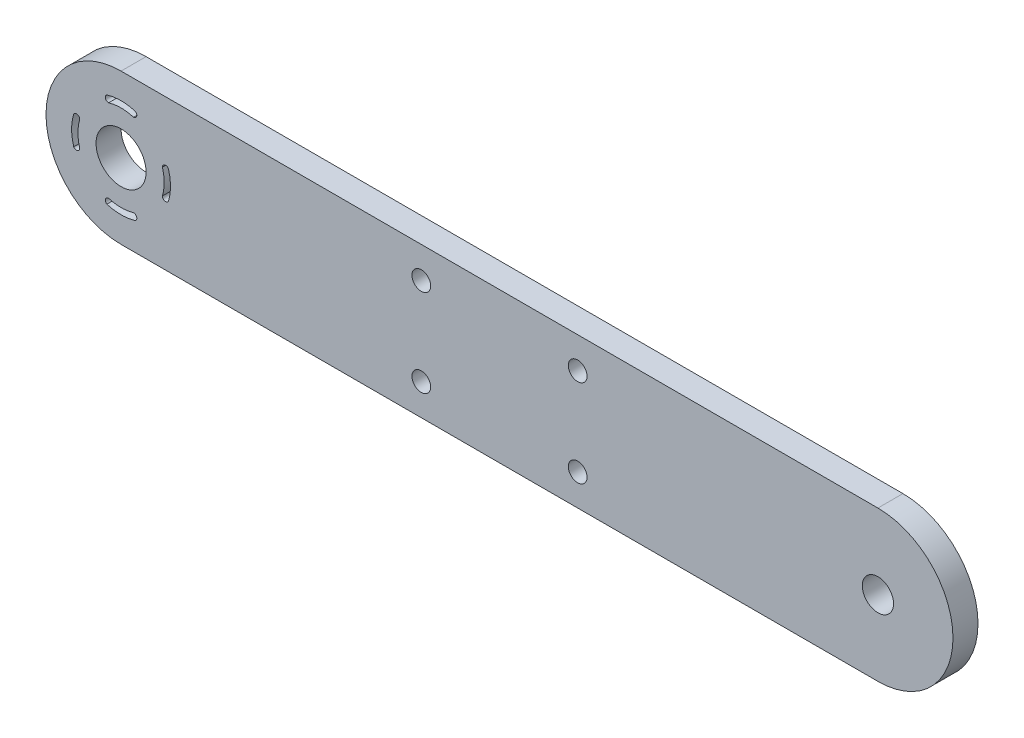
ISO-10303-21;
HEADER;
FILE_DESCRIPTION(('STEP AP214'),'2;1');
FILE_NAME('part.step','',(''),(''),'','','');
FILE_SCHEMA(('AUTOMOTIVE_DESIGN { 1 0 10303 214 1 1 1 1 }'));
ENDSEC;
DATA;
#1=APPLICATION_CONTEXT('core data for automotive mechanical design processes');
#2=APPLICATION_PROTOCOL_DEFINITION('international standard','automotive_design',2000,#1);
#3=PRODUCT_CONTEXT('',#1,'mechanical');
#4=PRODUCT('Part','Part','',(#3));
#5=PRODUCT_RELATED_PRODUCT_CATEGORY('part','',(#4));
#6=PRODUCT_DEFINITION_FORMATION('','',#4);
#7=PRODUCT_DEFINITION_CONTEXT('part definition',#1,'design');
#8=PRODUCT_DEFINITION('design','',#6,#7);
#9=PRODUCT_DEFINITION_SHAPE('','',#8);
#10=(LENGTH_UNIT() NAMED_UNIT(*) SI_UNIT(.MILLI.,.METRE.));
#11=(NAMED_UNIT(*) PLANE_ANGLE_UNIT() SI_UNIT($,.RADIAN.));
#12=(NAMED_UNIT(*) SI_UNIT($,.STERADIAN.) SOLID_ANGLE_UNIT());
#13=UNCERTAINTY_MEASURE_WITH_UNIT(LENGTH_MEASURE(1.E-05),#10,'distance_accuracy_value','');
#14=(GEOMETRIC_REPRESENTATION_CONTEXT(3) GLOBAL_UNCERTAINTY_ASSIGNED_CONTEXT((#13)) GLOBAL_UNIT_ASSIGNED_CONTEXT((#10,
#11,#12)) REPRESENTATION_CONTEXT('',''));
#15=CARTESIAN_POINT('',(0.,0.,0.));
#16=DIRECTION('',(0.,0.,1.));
#17=DIRECTION('',(1.,0.,0.));
#18=AXIS2_PLACEMENT_3D('',#15,#16,#17);
#19=CARTESIAN_POINT('',(12.0000004605686,12.0000001097863,4.));
#20=DIRECTION('',(0.,0.,1.));
#21=DIRECTION('',(1.,0.,0.));
#22=AXIS2_PLACEMENT_3D('',#19,#20,#21);
#23=PLANE('',#22);
#24=CARTESIAN_POINT('',(12.0000004605686,12.0000001097863,4.));
#25=DIRECTION('',(0.,0.,1.));
#26=DIRECTION('',(1.,0.,0.));
#27=AXIS2_PLACEMENT_3D('',#24,#25,#26);
#28=CIRCLE('',#27,7.89993735833253);
#29=CARTESIAN_POINT('',(14.270331999233,19.5666773838693,4.));
#30=VERTEX_POINT('',#29);
#31=CARTESIAN_POINT('',(9.72966892190426,19.5666773838693,4.));
#32=VERTEX_POINT('',#31);
#33=EDGE_CURVE('E207',#30,#32,#28,.T.);
#34=ORIENTED_EDGE('',*,*,#33,.F.);
#35=CARTESIAN_POINT('',(14.0000004605686,19.1232203595606,4.));
#36=DIRECTION('',(0.,0.,1.));
#37=DIRECTION('',(1.,0.,0.));
#38=AXIS2_PLACEMENT_3D('',#35,#36,#37);
#39=CIRCLE('',#38,0.519358520874882);
#40=CARTESIAN_POINT('',(14.0000004605685,18.6038618386857,4.));
#41=VERTEX_POINT('',#40);
#42=EDGE_CURVE('E205',#41,#30,#39,.T.);
#43=ORIENTED_EDGE('',*,*,#42,.F.);
#44=CARTESIAN_POINT('',(12.0000004605686,12.0000001097863,4.));
#45=DIRECTION('',(0.,0.,-1.));
#46=DIRECTION('',(1.,0.,0.));
#47=AXIS2_PLACEMENT_3D('',#44,#45,#46);
#48=CIRCLE('',#47,6.90007171951293);
#49=CARTESIAN_POINT('',(10.0000004605687,18.6038618386857,4.));
#50=VERTEX_POINT('',#49);
#51=EDGE_CURVE('E213',#50,#41,#48,.T.);
#52=ORIENTED_EDGE('',*,*,#51,.F.);
#53=CARTESIAN_POINT('',(10.0000004605686,19.1232203595606,4.));
#54=DIRECTION('',(0.,0.,1.));
#55=DIRECTION('',(1.,0.,0.));
#56=AXIS2_PLACEMENT_3D('',#53,#54,#55);
#57=CIRCLE('',#56,0.51935852087488);
#58=EDGE_CURVE('E210',#32,#50,#57,.T.);
#59=ORIENTED_EDGE('',*,*,#58,.F.);
#60=EDGE_LOOP('',(#34,#43,#52,#59));
#61=FACE_BOUND('',#60,.T.);
#62=CARTESIAN_POINT('',(12.0000004605686,12.0000001097863,4.));
#63=DIRECTION('',(0.,0.,1.));
#64=DIRECTION('',(1.,0.,0.));
#65=AXIS2_PLACEMENT_3D('',#62,#63,#64);
#66=CIRCLE('',#65,7.89993735833253);
#67=CARTESIAN_POINT('',(9.72966892190425,4.43332283570335,4.));
#68=VERTEX_POINT('',#67);
#69=CARTESIAN_POINT('',(14.270331999233,4.43332283570335,4.));
#70=VERTEX_POINT('',#69);
#71=EDGE_CURVE('E269',#68,#70,#66,.T.);
#72=ORIENTED_EDGE('',*,*,#71,.F.);
#73=CARTESIAN_POINT('',(10.0000004605686,4.87677986001203,4.));
#74=DIRECTION('',(0.,0.,1.));
#75=DIRECTION('',(1.,0.,0.));
#76=AXIS2_PLACEMENT_3D('',#73,#74,#75);
#77=CIRCLE('',#76,0.51935852087488);
#78=CARTESIAN_POINT('',(10.0000004605687,5.3961383808869,4.));
#79=VERTEX_POINT('',#78);
#80=EDGE_CURVE('E267',#79,#68,#77,.T.);
#81=ORIENTED_EDGE('',*,*,#80,.F.);
#82=CARTESIAN_POINT('',(12.0000004605686,12.0000001097863,4.));
#83=DIRECTION('',(0.,0.,-1.));
#84=DIRECTION('',(1.,0.,0.));
#85=AXIS2_PLACEMENT_3D('',#82,#83,#84);
#86=CIRCLE('',#85,6.90007171951293);
#87=CARTESIAN_POINT('',(14.0000004605685,5.3961383808869,4.));
#88=VERTEX_POINT('',#87);
#89=EDGE_CURVE('E275',#88,#79,#86,.T.);
#90=ORIENTED_EDGE('',*,*,#89,.F.);
#91=CARTESIAN_POINT('',(14.0000004605686,4.87677986001203,4.));
#92=DIRECTION('',(0.,0.,1.));
#93=DIRECTION('',(1.,0.,0.));
#94=AXIS2_PLACEMENT_3D('',#91,#92,#93);
#95=CIRCLE('',#94,0.51935852087488);
#96=EDGE_CURVE('E272',#70,#88,#95,.T.);
#97=ORIENTED_EDGE('',*,*,#96,.F.);
#98=EDGE_LOOP('',(#72,#81,#90,#97));
#99=FACE_BOUND('',#98,.T.);
#100=CARTESIAN_POINT('',(85.0000004605686,19.0000001097863,4.));
#101=DIRECTION('',(0.,0.,1.));
#102=DIRECTION('',(1.,0.,0.));
#103=AXIS2_PLACEMENT_3D('',#100,#101,#102);
#104=CIRCLE('',#103,1.5);
#105=CARTESIAN_POINT('',(86.5000004605686,19.0000001097863,4.));
#106=VERTEX_POINT('',#105);
#107=EDGE_CURVE('E304',#106,#106,#104,.T.);
#108=ORIENTED_EDGE('',*,*,#107,.F.);
#109=EDGE_LOOP('',(#108));
#110=FACE_BOUND('',#109,.T.);
#111=CARTESIAN_POINT('',(60.0000004605686,19.0000001097863,4.));
#112=DIRECTION('',(0.,0.,1.));
#113=DIRECTION('',(1.,0.,0.));
#114=AXIS2_PLACEMENT_3D('',#111,#112,#113);
#115=CIRCLE('',#114,1.5);
#116=CARTESIAN_POINT('',(61.5000004605686,19.0000001097863,4.));
#117=VERTEX_POINT('',#116);
#118=EDGE_CURVE('E316',#117,#117,#115,.T.);
#119=ORIENTED_EDGE('',*,*,#118,.F.);
#120=EDGE_LOOP('',(#119));
#121=FACE_BOUND('',#120,.T.);
#122=CARTESIAN_POINT('',(12.0000004605686,12.0000001097863,4.));
#123=DIRECTION('',(0.,0.,1.));
#124=DIRECTION('',(1.,0.,0.));
#125=AXIS2_PLACEMENT_3D('',#122,#123,#124);
#126=CIRCLE('',#125,4.);
#127=CARTESIAN_POINT('',(16.0000004605686,12.0000001097863,4.));
#128=VERTEX_POINT('',#127);
#129=EDGE_CURVE('E328',#128,#128,#126,.T.);
#130=ORIENTED_EDGE('',*,*,#129,.F.);
#131=EDGE_LOOP('',(#130));
#132=FACE_BOUND('',#131,.T.);
#133=CARTESIAN_POINT('',(12.0000004605686,12.0000001097863,4.));
#134=DIRECTION('',(0.,0.,1.));
#135=DIRECTION('',(1.,0.,0.));
#136=AXIS2_PLACEMENT_3D('',#133,#134,#135);
#137=CIRCLE('',#136,12.);
#138=CARTESIAN_POINT('',(12.0000004605686,24.0000001097863,4.));
#139=VERTEX_POINT('',#138);
#140=CARTESIAN_POINT('',(12.0000004605686,1.09786320479088E-07,4.));
#141=VERTEX_POINT('',#140);
#142=EDGE_CURVE('E334',#139,#141,#137,.T.);
#143=ORIENTED_EDGE('',*,*,#142,.T.);
#144=DIRECTION('',(1.,0.,0.));
#145=VECTOR('',#144,1.);
#146=CARTESIAN_POINT('',(133.000000460569,1.09786320479088E-07,4.));
#147=LINE('',#146,#145);
#148=CARTESIAN_POINT('',(133.000000460569,1.097863206595E-07,4.));
#149=VERTEX_POINT('',#148);
#150=EDGE_CURVE('E337',#141,#149,#147,.T.);
#151=ORIENTED_EDGE('',*,*,#150,.T.);
#152=CARTESIAN_POINT('',(133.000000460569,12.0000001097863,4.));
#153=DIRECTION('',(0.,0.,1.));
#154=DIRECTION('',(1.,0.,0.));
#155=AXIS2_PLACEMENT_3D('',#152,#153,#154);
#156=CIRCLE('',#155,12.);
#157=CARTESIAN_POINT('',(133.000000460569,24.0000001097863,4.));
#158=VERTEX_POINT('',#157);
#159=EDGE_CURVE('E340',#149,#158,#156,.T.);
#160=ORIENTED_EDGE('',*,*,#159,.T.);
#161=DIRECTION('',(-1.,0.,0.));
#162=VECTOR('',#161,1.);
#163=CARTESIAN_POINT('',(12.0000004605686,24.0000001097863,4.));
#164=LINE('',#163,#162);
#165=EDGE_CURVE('E342',#158,#139,#164,.T.);
#166=ORIENTED_EDGE('',*,*,#165,.T.);
#167=EDGE_LOOP('',(#143,#151,#160,#166));
#168=FACE_BOUND('',#167,.T.);
#169=CARTESIAN_POINT('',(60.0000004605686,5.00000010978632,4.));
#170=DIRECTION('',(0.,0.,1.));
#171=DIRECTION('',(1.,0.,0.));
#172=AXIS2_PLACEMENT_3D('',#169,#170,#171);
#173=CIRCLE('',#172,1.5);
#174=CARTESIAN_POINT('',(61.5000004605686,5.00000010978632,4.));
#175=VERTEX_POINT('',#174);
#176=EDGE_CURVE('E322',#175,#175,#173,.T.);
#177=ORIENTED_EDGE('',*,*,#176,.F.);
#178=EDGE_LOOP('',(#177));
#179=FACE_BOUND('',#178,.T.);
#180=CARTESIAN_POINT('',(85.0000004605686,5.00000010978632,4.));
#181=DIRECTION('',(0.,0.,1.));
#182=DIRECTION('',(1.,0.,0.));
#183=AXIS2_PLACEMENT_3D('',#180,#181,#182);
#184=CIRCLE('',#183,1.5);
#185=CARTESIAN_POINT('',(86.5000004605686,5.00000010978632,4.));
#186=VERTEX_POINT('',#185);
#187=EDGE_CURVE('E310',#186,#186,#184,.T.);
#188=ORIENTED_EDGE('',*,*,#187,.F.);
#189=EDGE_LOOP('',(#188));
#190=FACE_BOUND('',#189,.T.);
#191=CARTESIAN_POINT('',(133.000000460569,12.0000001097863,4.));
#192=DIRECTION('',(0.,0.,1.));
#193=DIRECTION('',(1.,0.,0.));
#194=AXIS2_PLACEMENT_3D('',#191,#192,#193);
#195=CIRCLE('',#194,2.5);
#196=CARTESIAN_POINT('',(135.500000460569,12.0000001097863,4.));
#197=VERTEX_POINT('',#196);
#198=EDGE_CURVE('E298',#197,#197,#195,.T.);
#199=ORIENTED_EDGE('',*,*,#198,.F.);
#200=EDGE_LOOP('',(#199));
#201=FACE_BOUND('',#200,.T.);
#202=CARTESIAN_POINT('',(12.0000004605686,12.0000001097863,4.));
#203=DIRECTION('',(0.,0.,1.));
#204=DIRECTION('',(1.,0.,0.));
#205=AXIS2_PLACEMENT_3D('',#202,#203,#204);
#206=CIRCLE('',#205,7.89993735833252);
#207=CARTESIAN_POINT('',(19.5666777346516,9.72966857112182,4.));
#208=VERTEX_POINT('',#207);
#209=CARTESIAN_POINT('',(19.5666777346516,14.2703316484507,4.));
#210=VERTEX_POINT('',#209);
#211=EDGE_CURVE('E238',#208,#210,#206,.T.);
#212=ORIENTED_EDGE('',*,*,#211,.F.);
#213=CARTESIAN_POINT('',(19.1232207103428,10.0000001097863,4.));
#214=DIRECTION('',(0.,0.,1.));
#215=DIRECTION('',(1.,0.,0.));
#216=AXIS2_PLACEMENT_3D('',#213,#214,#215);
#217=CIRCLE('',#216,0.5193585208749);
#218=CARTESIAN_POINT('',(18.603862189468,10.0000001097864,4.));
#219=VERTEX_POINT('',#218);
#220=EDGE_CURVE('E236',#219,#208,#217,.T.);
#221=ORIENTED_EDGE('',*,*,#220,.F.);
#222=CARTESIAN_POINT('',(12.0000004605686,12.0000001097863,4.));
#223=DIRECTION('',(0.,0.,-1.));
#224=DIRECTION('',(1.,0.,0.));
#225=AXIS2_PLACEMENT_3D('',#222,#223,#224);
#226=CIRCLE('',#225,6.90007171951293);
#227=CARTESIAN_POINT('',(18.603862189468,14.0000001097863,4.));
#228=VERTEX_POINT('',#227);
#229=EDGE_CURVE('E244',#228,#219,#226,.T.);
#230=ORIENTED_EDGE('',*,*,#229,.F.);
#231=CARTESIAN_POINT('',(19.1232207103428,14.0000001097863,4.));
#232=DIRECTION('',(0.,0.,1.));
#233=DIRECTION('',(1.,0.,0.));
#234=AXIS2_PLACEMENT_3D('',#231,#232,#233);
#235=CIRCLE('',#234,0.519358520874886);
#236=EDGE_CURVE('E241',#210,#228,#235,.T.);
#237=ORIENTED_EDGE('',*,*,#236,.F.);
#238=EDGE_LOOP('',(#212,#221,#230,#237));
#239=FACE_BOUND('',#238,.T.);
#240=CARTESIAN_POINT('',(12.0000004605686,12.0000001097863,4.));
#241=DIRECTION('',(0.,0.,1.));
#242=DIRECTION('',(1.,0.,0.));
#243=AXIS2_PLACEMENT_3D('',#240,#241,#242);
#244=CIRCLE('',#243,7.89993735833252);
#245=CARTESIAN_POINT('',(4.4333231864857,14.2703316484508,4.));
#246=VERTEX_POINT('',#245);
#247=CARTESIAN_POINT('',(4.43332318648569,9.72966857112184,4.));
#248=VERTEX_POINT('',#247);
#249=EDGE_CURVE('E177',#246,#248,#244,.T.);
#250=ORIENTED_EDGE('',*,*,#249,.F.);
#251=CARTESIAN_POINT('',(4.87678021079424,14.0000001097863,4.));
#252=DIRECTION('',(0.,0.,1.));
#253=DIRECTION('',(1.,0.,0.));
#254=AXIS2_PLACEMENT_3D('',#251,#252,#253);
#255=CIRCLE('',#254,0.519358520874917);
#256=CARTESIAN_POINT('',(5.39613873166923,14.0000001097863,4.));
#257=VERTEX_POINT('',#256);
#258=EDGE_CURVE('E169',#257,#246,#255,.T.);
#259=ORIENTED_EDGE('',*,*,#258,.F.);
#260=CARTESIAN_POINT('',(12.0000004605686,12.0000001097863,4.));
#261=DIRECTION('',(0.,0.,-1.));
#262=DIRECTION('',(1.,0.,0.));
#263=AXIS2_PLACEMENT_3D('',#260,#261,#262);
#264=CIRCLE('',#263,6.90007171951293);
#265=CARTESIAN_POINT('',(5.39613873166921,10.0000001097864,4.));
#266=VERTEX_POINT('',#265);
#267=EDGE_CURVE('E191',#266,#257,#264,.T.);
#268=ORIENTED_EDGE('',*,*,#267,.F.);
#269=CARTESIAN_POINT('',(4.87678021079424,10.0000001097863,4.));
#270=DIRECTION('',(0.,0.,1.));
#271=DIRECTION('',(1.,0.,0.));
#272=AXIS2_PLACEMENT_3D('',#269,#270,#271);
#273=CIRCLE('',#272,0.519358520874907);
#274=EDGE_CURVE('E189',#248,#266,#273,.T.);
#275=ORIENTED_EDGE('',*,*,#274,.F.);
#276=EDGE_LOOP('',(#250,#259,#268,#275));
#277=FACE_BOUND('',#276,.T.);
#278=ADVANCED_FACE('F32',(#61,#99,#110,#121,#132,#168,#179,#190,#201,#239,#277),#23,.T.);
#279=CARTESIAN_POINT('',(12.0000004605686,12.0000001097863,0.));
#280=DIRECTION('',(0.,0.,1.));
#281=DIRECTION('',(1.,0.,0.));
#282=AXIS2_PLACEMENT_3D('',#279,#280,#281);
#283=PLANE('',#282);
#284=CARTESIAN_POINT('',(14.0000004605686,19.1232203595606,0.));
#285=DIRECTION('',(0.,0.,1.));
#286=DIRECTION('',(1.,0.,0.));
#287=AXIS2_PLACEMENT_3D('',#284,#285,#286);
#288=CIRCLE('',#287,0.519358520874882);
#289=CARTESIAN_POINT('',(14.0000004605685,18.6038618386857,0.));
#290=VERTEX_POINT('',#289);
#291=CARTESIAN_POINT('',(14.270331999233,19.5666773838693,0.));
#292=VERTEX_POINT('',#291);
#293=EDGE_CURVE('E185',#290,#292,#288,.T.);
#294=ORIENTED_EDGE('',*,*,#293,.T.);
#295=CARTESIAN_POINT('',(12.0000004605686,12.0000001097863,0.));
#296=DIRECTION('',(0.,0.,1.));
#297=DIRECTION('',(1.,0.,0.));
#298=AXIS2_PLACEMENT_3D('',#295,#296,#297);
#299=CIRCLE('',#298,7.89993735833253);
#300=CARTESIAN_POINT('',(9.72966892190426,19.5666773838693,0.));
#301=VERTEX_POINT('',#300);
#302=EDGE_CURVE('E218',#292,#301,#299,.T.);
#303=ORIENTED_EDGE('',*,*,#302,.T.);
#304=CARTESIAN_POINT('',(10.0000004605686,19.1232203595606,0.));
#305=DIRECTION('',(0.,0.,1.));
#306=DIRECTION('',(1.,0.,0.));
#307=AXIS2_PLACEMENT_3D('',#304,#305,#306);
#308=CIRCLE('',#307,0.51935852087488);
#309=CARTESIAN_POINT('',(10.0000004605687,18.6038618386857,0.));
#310=VERTEX_POINT('',#309);
#311=EDGE_CURVE('E221',#301,#310,#308,.T.);
#312=ORIENTED_EDGE('',*,*,#311,.T.);
#313=CARTESIAN_POINT('',(12.0000004605686,12.0000001097863,0.));
#314=DIRECTION('',(0.,0.,-1.));
#315=DIRECTION('',(1.,0.,0.));
#316=AXIS2_PLACEMENT_3D('',#313,#314,#315);
#317=CIRCLE('',#316,6.90007171951293);
#318=EDGE_CURVE('E208',#310,#290,#317,.T.);
#319=ORIENTED_EDGE('',*,*,#318,.T.);
#320=EDGE_LOOP('',(#294,#303,#312,#319));
#321=FACE_BOUND('',#320,.T.);
#322=CARTESIAN_POINT('',(10.0000004605686,4.87677986001203,0.));
#323=DIRECTION('',(0.,0.,1.));
#324=DIRECTION('',(1.,0.,0.));
#325=AXIS2_PLACEMENT_3D('',#322,#323,#324);
#326=CIRCLE('',#325,0.51935852087488);
#327=CARTESIAN_POINT('',(10.0000004605687,5.3961383808869,0.));
#328=VERTEX_POINT('',#327);
#329=CARTESIAN_POINT('',(9.72966892190425,4.43332283570335,0.));
#330=VERTEX_POINT('',#329);
#331=EDGE_CURVE('E266',#328,#330,#326,.T.);
#332=ORIENTED_EDGE('',*,*,#331,.T.);
#333=CARTESIAN_POINT('',(12.0000004605686,12.0000001097863,0.));
#334=DIRECTION('',(0.,0.,1.));
#335=DIRECTION('',(1.,0.,0.));
#336=AXIS2_PLACEMENT_3D('',#333,#334,#335);
#337=CIRCLE('',#336,7.89993735833253);
#338=CARTESIAN_POINT('',(14.270331999233,4.43332283570335,0.));
#339=VERTEX_POINT('',#338);
#340=EDGE_CURVE('E280',#330,#339,#337,.T.);
#341=ORIENTED_EDGE('',*,*,#340,.T.);
#342=CARTESIAN_POINT('',(14.0000004605686,4.87677986001203,0.));
#343=DIRECTION('',(0.,0.,1.));
#344=DIRECTION('',(1.,0.,0.));
#345=AXIS2_PLACEMENT_3D('',#342,#343,#344);
#346=CIRCLE('',#345,0.51935852087488);
#347=CARTESIAN_POINT('',(14.0000004605685,5.39613838088692,0.));
#348=VERTEX_POINT('',#347);
#349=EDGE_CURVE('E283',#339,#348,#346,.T.);
#350=ORIENTED_EDGE('',*,*,#349,.T.);
#351=CARTESIAN_POINT('',(12.0000004605686,12.0000001097863,0.));
#352=DIRECTION('',(0.,0.,-1.));
#353=DIRECTION('',(1.,0.,0.));
#354=AXIS2_PLACEMENT_3D('',#351,#352,#353);
#355=CIRCLE('',#354,6.90007171951293);
#356=EDGE_CURVE('E270',#348,#328,#355,.T.);
#357=ORIENTED_EDGE('',*,*,#356,.T.);
#358=EDGE_LOOP('',(#332,#341,#350,#357));
#359=FACE_BOUND('',#358,.T.);
#360=CARTESIAN_POINT('',(85.0000004605686,19.0000001097863,0.));
#361=DIRECTION('',(0.,0.,1.));
#362=DIRECTION('',(1.,0.,0.));
#363=AXIS2_PLACEMENT_3D('',#360,#361,#362);
#364=CIRCLE('',#363,1.5);
#365=CARTESIAN_POINT('',(86.5000004605686,19.0000001097863,0.));
#366=VERTEX_POINT('',#365);
#367=EDGE_CURVE('E301',#366,#366,#364,.T.);
#368=ORIENTED_EDGE('',*,*,#367,.T.);
#369=EDGE_LOOP('',(#368));
#370=FACE_BOUND('',#369,.T.);
#371=CARTESIAN_POINT('',(60.0000004605686,19.0000001097863,0.));
#372=DIRECTION('',(0.,0.,1.));
#373=DIRECTION('',(1.,0.,0.));
#374=AXIS2_PLACEMENT_3D('',#371,#372,#373);
#375=CIRCLE('',#374,1.5);
#376=CARTESIAN_POINT('',(61.5000004605686,19.0000001097863,0.));
#377=VERTEX_POINT('',#376);
#378=EDGE_CURVE('E313',#377,#377,#375,.T.);
#379=ORIENTED_EDGE('',*,*,#378,.T.);
#380=EDGE_LOOP('',(#379));
#381=FACE_BOUND('',#380,.T.);
#382=CARTESIAN_POINT('',(12.0000004605686,12.0000001097863,0.));
#383=DIRECTION('',(0.,0.,1.));
#384=DIRECTION('',(1.,0.,0.));
#385=AXIS2_PLACEMENT_3D('',#382,#383,#384);
#386=CIRCLE('',#385,4.);
#387=CARTESIAN_POINT('',(16.0000004605686,12.0000001097863,0.));
#388=VERTEX_POINT('',#387);
#389=EDGE_CURVE('E325',#388,#388,#386,.T.);
#390=ORIENTED_EDGE('',*,*,#389,.T.);
#391=EDGE_LOOP('',(#390));
#392=FACE_BOUND('',#391,.T.);
#393=CARTESIAN_POINT('',(12.0000004605686,12.0000001097863,0.));
#394=DIRECTION('',(0.,0.,1.));
#395=DIRECTION('',(1.,0.,0.));
#396=AXIS2_PLACEMENT_3D('',#393,#394,#395);
#397=CIRCLE('',#396,12.);
#398=CARTESIAN_POINT('',(12.0000004605686,24.0000001097863,0.));
#399=VERTEX_POINT('',#398);
#400=CARTESIAN_POINT('',(12.0000004605686,1.09786320479088E-07,0.));
#401=VERTEX_POINT('',#400);
#402=EDGE_CURVE('E331',#399,#401,#397,.T.);
#403=ORIENTED_EDGE('',*,*,#402,.F.);
#404=DIRECTION('',(-1.,0.,0.));
#405=VECTOR('',#404,1.);
#406=CARTESIAN_POINT('',(12.0000004605686,24.0000001097863,0.));
#407=LINE('',#406,#405);
#408=CARTESIAN_POINT('',(133.000000460569,24.0000001097863,0.));
#409=VERTEX_POINT('',#408);
#410=EDGE_CURVE('E338',#409,#399,#407,.T.);
#411=ORIENTED_EDGE('',*,*,#410,.F.);
#412=CARTESIAN_POINT('',(133.000000460569,12.0000001097863,0.));
#413=DIRECTION('',(0.,0.,1.));
#414=DIRECTION('',(1.,0.,0.));
#415=AXIS2_PLACEMENT_3D('',#412,#413,#414);
#416=CIRCLE('',#415,12.);
#417=CARTESIAN_POINT('',(133.000000460569,1.097863206595E-07,0.));
#418=VERTEX_POINT('',#417);
#419=EDGE_CURVE('E349',#418,#409,#416,.T.);
#420=ORIENTED_EDGE('',*,*,#419,.F.);
#421=DIRECTION('',(1.,0.,0.));
#422=VECTOR('',#421,1.);
#423=CARTESIAN_POINT('',(133.000000460569,1.09786320479088E-07,0.));
#424=LINE('',#423,#422);
#425=EDGE_CURVE('E347',#401,#418,#424,.T.);
#426=ORIENTED_EDGE('',*,*,#425,.F.);
#427=EDGE_LOOP('',(#403,#411,#420,#426));
#428=FACE_BOUND('',#427,.T.);
#429=CARTESIAN_POINT('',(60.0000004605686,5.00000010978632,0.));
#430=DIRECTION('',(0.,0.,1.));
#431=DIRECTION('',(1.,0.,0.));
#432=AXIS2_PLACEMENT_3D('',#429,#430,#431);
#433=CIRCLE('',#432,1.5);
#434=CARTESIAN_POINT('',(61.5000004605686,5.00000010978632,0.));
#435=VERTEX_POINT('',#434);
#436=EDGE_CURVE('E319',#435,#435,#433,.T.);
#437=ORIENTED_EDGE('',*,*,#436,.T.);
#438=EDGE_LOOP('',(#437));
#439=FACE_BOUND('',#438,.T.);
#440=CARTESIAN_POINT('',(85.0000004605686,5.00000010978632,0.));
#441=DIRECTION('',(0.,0.,1.));
#442=DIRECTION('',(1.,0.,0.));
#443=AXIS2_PLACEMENT_3D('',#440,#441,#442);
#444=CIRCLE('',#443,1.5);
#445=CARTESIAN_POINT('',(86.5000004605686,5.00000010978632,0.));
#446=VERTEX_POINT('',#445);
#447=EDGE_CURVE('E307',#446,#446,#444,.T.);
#448=ORIENTED_EDGE('',*,*,#447,.T.);
#449=EDGE_LOOP('',(#448));
#450=FACE_BOUND('',#449,.T.);
#451=CARTESIAN_POINT('',(133.000000460569,12.0000001097863,0.));
#452=DIRECTION('',(0.,0.,1.));
#453=DIRECTION('',(1.,0.,0.));
#454=AXIS2_PLACEMENT_3D('',#451,#452,#453);
#455=CIRCLE('',#454,2.5);
#456=CARTESIAN_POINT('',(135.500000460569,12.0000001097863,0.));
#457=VERTEX_POINT('',#456);
#458=EDGE_CURVE('E297',#457,#457,#455,.T.);
#459=ORIENTED_EDGE('',*,*,#458,.T.);
#460=EDGE_LOOP('',(#459));
#461=FACE_BOUND('',#460,.T.);
#462=CARTESIAN_POINT('',(19.1232207103428,10.0000001097863,0.));
#463=DIRECTION('',(0.,0.,1.));
#464=DIRECTION('',(1.,0.,0.));
#465=AXIS2_PLACEMENT_3D('',#462,#463,#464);
#466=CIRCLE('',#465,0.5193585208749);
#467=CARTESIAN_POINT('',(18.603862189468,10.0000001097864,0.));
#468=VERTEX_POINT('',#467);
#469=CARTESIAN_POINT('',(19.5666777346516,9.72966857112182,0.));
#470=VERTEX_POINT('',#469);
#471=EDGE_CURVE('E235',#468,#470,#466,.T.);
#472=ORIENTED_EDGE('',*,*,#471,.T.);
#473=CARTESIAN_POINT('',(12.0000004605686,12.0000001097863,0.));
#474=DIRECTION('',(0.,0.,1.));
#475=DIRECTION('',(1.,0.,0.));
#476=AXIS2_PLACEMENT_3D('',#473,#474,#475);
#477=CIRCLE('',#476,7.89993735833252);
#478=CARTESIAN_POINT('',(19.5666777346516,14.2703316484507,0.));
#479=VERTEX_POINT('',#478);
#480=EDGE_CURVE('E249',#470,#479,#477,.T.);
#481=ORIENTED_EDGE('',*,*,#480,.T.);
#482=CARTESIAN_POINT('',(19.1232207103428,14.0000001097863,0.));
#483=DIRECTION('',(0.,0.,1.));
#484=DIRECTION('',(1.,0.,0.));
#485=AXIS2_PLACEMENT_3D('',#482,#483,#484);
#486=CIRCLE('',#485,0.519358520874886);
#487=CARTESIAN_POINT('',(18.6038621894679,14.0000001097863,0.));
#488=VERTEX_POINT('',#487);
#489=EDGE_CURVE('E252',#479,#488,#486,.T.);
#490=ORIENTED_EDGE('',*,*,#489,.T.);
#491=CARTESIAN_POINT('',(12.0000004605686,12.0000001097863,0.));
#492=DIRECTION('',(0.,0.,-1.));
#493=DIRECTION('',(1.,0.,0.));
#494=AXIS2_PLACEMENT_3D('',#491,#492,#493);
#495=CIRCLE('',#494,6.90007171951293);
#496=EDGE_CURVE('E239',#488,#468,#495,.T.);
#497=ORIENTED_EDGE('',*,*,#496,.T.);
#498=EDGE_LOOP('',(#472,#481,#490,#497));
#499=FACE_BOUND('',#498,.T.);
#500=CARTESIAN_POINT('',(4.87678021079424,14.0000001097863,0.));
#501=DIRECTION('',(0.,0.,1.));
#502=DIRECTION('',(1.,0.,0.));
#503=AXIS2_PLACEMENT_3D('',#500,#501,#502);
#504=CIRCLE('',#503,0.519358520874917);
#505=CARTESIAN_POINT('',(5.39613873166923,14.0000001097863,0.));
#506=VERTEX_POINT('',#505);
#507=CARTESIAN_POINT('',(4.4333231864857,14.2703316484508,0.));
#508=VERTEX_POINT('',#507);
#509=EDGE_CURVE('E55',#506,#508,#504,.T.);
#510=ORIENTED_EDGE('',*,*,#509,.T.);
#511=CARTESIAN_POINT('',(12.0000004605686,12.0000001097863,0.));
#512=DIRECTION('',(0.,0.,1.));
#513=DIRECTION('',(1.,0.,0.));
#514=AXIS2_PLACEMENT_3D('',#511,#512,#513);
#515=CIRCLE('',#514,7.89993735833252);
#516=CARTESIAN_POINT('',(4.43332318648569,9.72966857112184,0.));
#517=VERTEX_POINT('',#516);
#518=EDGE_CURVE('E184',#508,#517,#515,.T.);
#519=ORIENTED_EDGE('',*,*,#518,.T.);
#520=CARTESIAN_POINT('',(4.87678021079424,10.0000001097863,0.));
#521=DIRECTION('',(0.,0.,1.));
#522=DIRECTION('',(1.,0.,0.));
#523=AXIS2_PLACEMENT_3D('',#520,#521,#522);
#524=CIRCLE('',#523,0.519358520874907);
#525=CARTESIAN_POINT('',(5.39613873166914,10.0000001097864,0.));
#526=VERTEX_POINT('',#525);
#527=EDGE_CURVE('E197',#517,#526,#524,.T.);
#528=ORIENTED_EDGE('',*,*,#527,.T.);
#529=CARTESIAN_POINT('',(12.0000004605686,12.0000001097863,0.));
#530=DIRECTION('',(0.,0.,-1.));
#531=DIRECTION('',(1.,0.,0.));
#532=AXIS2_PLACEMENT_3D('',#529,#530,#531);
#533=CIRCLE('',#532,6.90007171951293);
#534=EDGE_CURVE('E178',#526,#506,#533,.T.);
#535=ORIENTED_EDGE('',*,*,#534,.T.);
#536=EDGE_LOOP('',(#510,#519,#528,#535));
#537=FACE_BOUND('',#536,.T.);
#538=ADVANCED_FACE('F367',(#321,#359,#370,#381,#392,#428,#439,#450,#461,#499,#537),#283,.F.);
#539=CARTESIAN_POINT('',(12.0000004605686,12.0000001097863,4.));
#540=DIRECTION('',(0.,0.,-1.));
#541=DIRECTION('',(-1.,0.,0.));
#542=AXIS2_PLACEMENT_3D('',#539,#540,#541);
#543=CYLINDRICAL_SURFACE('',#542,12.);
#544=ORIENTED_EDGE('',*,*,#402,.T.);
#545=DIRECTION('',(0.,0.,-1.));
#546=VECTOR('',#545,1.);
#547=CARTESIAN_POINT('',(12.0000004605686,1.09786320479088E-07,4.));
#548=LINE('',#547,#546);
#549=EDGE_CURVE('E11',#141,#401,#548,.T.);
#550=ORIENTED_EDGE('',*,*,#549,.F.);
#551=ORIENTED_EDGE('',*,*,#142,.F.);
#552=DIRECTION('',(0.,0.,-1.));
#553=VECTOR('',#552,1.);
#554=CARTESIAN_POINT('',(12.0000004605686,24.0000001097863,4.));
#555=LINE('',#554,#553);
#556=EDGE_CURVE('E344',#139,#399,#555,.T.);
#557=ORIENTED_EDGE('',*,*,#556,.T.);
#558=EDGE_LOOP('',(#544,#550,#551,#557));
#559=FACE_BOUND('',#558,.T.);
#560=ADVANCED_FACE('F34',(#559),#543,.T.);
#561=CARTESIAN_POINT('',(133.000000460569,1.09786320479088E-07,4.));
#562=DIRECTION('',(0.,1.,0.));
#563=DIRECTION('',(0.,0.,1.));
#564=AXIS2_PLACEMENT_3D('',#561,#562,#563);
#565=PLANE('',#564);
#566=ORIENTED_EDGE('',*,*,#425,.T.);
#567=DIRECTION('',(0.,0.,-1.));
#568=VECTOR('',#567,1.);
#569=CARTESIAN_POINT('',(133.000000460569,1.097863206595E-07,4.));
#570=LINE('',#569,#568);
#571=EDGE_CURVE('E40',#149,#418,#570,.T.);
#572=ORIENTED_EDGE('',*,*,#571,.F.);
#573=ORIENTED_EDGE('',*,*,#150,.F.);
#574=ORIENTED_EDGE('',*,*,#549,.T.);
#575=EDGE_LOOP('',(#566,#572,#573,#574));
#576=FACE_BOUND('',#575,.T.);
#577=ADVANCED_FACE('F378',(#576),#565,.F.);
#578=CARTESIAN_POINT('',(133.000000460569,12.0000001097863,4.));
#579=DIRECTION('',(0.,0.,-1.));
#580=DIRECTION('',(-1.,0.,0.));
#581=AXIS2_PLACEMENT_3D('',#578,#579,#580);
#582=CYLINDRICAL_SURFACE('',#581,12.);
#583=ORIENTED_EDGE('',*,*,#419,.T.);
#584=DIRECTION('',(0.,0.,-1.));
#585=VECTOR('',#584,1.);
#586=CARTESIAN_POINT('',(133.000000460569,24.0000001097863,4.));
#587=LINE('',#586,#585);
#588=EDGE_CURVE('E354',#158,#409,#587,.T.);
#589=ORIENTED_EDGE('',*,*,#588,.F.);
#590=ORIENTED_EDGE('',*,*,#159,.F.);
#591=ORIENTED_EDGE('',*,*,#571,.T.);
#592=EDGE_LOOP('',(#583,#589,#590,#591));
#593=FACE_BOUND('',#592,.T.);
#594=ADVANCED_FACE('F361',(#593),#582,.T.);
#595=CARTESIAN_POINT('',(12.0000004605686,24.0000001097863,4.));
#596=DIRECTION('',(0.,-1.,0.));
#597=DIRECTION('',(0.,0.,-1.));
#598=AXIS2_PLACEMENT_3D('',#595,#596,#597);
#599=PLANE('',#598);
#600=ORIENTED_EDGE('',*,*,#410,.T.);
#601=ORIENTED_EDGE('',*,*,#556,.F.);
#602=ORIENTED_EDGE('',*,*,#165,.F.);
#603=ORIENTED_EDGE('',*,*,#588,.T.);
#604=EDGE_LOOP('',(#600,#601,#602,#603));
#605=FACE_BOUND('',#604,.T.);
#606=ADVANCED_FACE('F371',(#605),#599,.F.);
#607=CARTESIAN_POINT('',(12.0000004605686,12.0000001097863,4.));
#608=DIRECTION('',(0.,0.,-1.));
#609=DIRECTION('',(-1.,0.,0.));
#610=AXIS2_PLACEMENT_3D('',#607,#608,#609);
#611=CYLINDRICAL_SURFACE('',#610,4.);
#612=ORIENTED_EDGE('',*,*,#129,.T.);
#613=EDGE_LOOP('',(#612));
#614=FACE_BOUND('',#613,.T.);
#615=ORIENTED_EDGE('',*,*,#389,.F.);
#616=EDGE_LOOP('',(#615));
#617=FACE_BOUND('',#616,.T.);
#618=ADVANCED_FACE('F396',(#614,#617),#611,.F.);
#619=CARTESIAN_POINT('',(60.0000004605686,5.00000010978632,4.));
#620=DIRECTION('',(0.,0.,-1.));
#621=DIRECTION('',(-1.,0.,0.));
#622=AXIS2_PLACEMENT_3D('',#619,#620,#621);
#623=CYLINDRICAL_SURFACE('',#622,1.5);
#624=ORIENTED_EDGE('',*,*,#176,.T.);
#625=EDGE_LOOP('',(#624));
#626=FACE_BOUND('',#625,.T.);
#627=ORIENTED_EDGE('',*,*,#436,.F.);
#628=EDGE_LOOP('',(#627));
#629=FACE_BOUND('',#628,.T.);
#630=ADVANCED_FACE('F403',(#626,#629),#623,.F.);
#631=CARTESIAN_POINT('',(60.0000004605686,19.0000001097863,4.));
#632=DIRECTION('',(0.,0.,-1.));
#633=DIRECTION('',(-1.,0.,0.));
#634=AXIS2_PLACEMENT_3D('',#631,#632,#633);
#635=CYLINDRICAL_SURFACE('',#634,1.5);
#636=ORIENTED_EDGE('',*,*,#118,.T.);
#637=EDGE_LOOP('',(#636));
#638=FACE_BOUND('',#637,.T.);
#639=ORIENTED_EDGE('',*,*,#378,.F.);
#640=EDGE_LOOP('',(#639));
#641=FACE_BOUND('',#640,.T.);
#642=ADVANCED_FACE('F408',(#638,#641),#635,.F.);
#643=CARTESIAN_POINT('',(85.0000004605686,5.00000010978632,4.));
#644=DIRECTION('',(0.,0.,-1.));
#645=DIRECTION('',(-1.,0.,0.));
#646=AXIS2_PLACEMENT_3D('',#643,#644,#645);
#647=CYLINDRICAL_SURFACE('',#646,1.5);
#648=ORIENTED_EDGE('',*,*,#187,.T.);
#649=EDGE_LOOP('',(#648));
#650=FACE_BOUND('',#649,.T.);
#651=ORIENTED_EDGE('',*,*,#447,.F.);
#652=EDGE_LOOP('',(#651));
#653=FACE_BOUND('',#652,.T.);
#654=ADVANCED_FACE('F418',(#650,#653),#647,.F.);
#655=CARTESIAN_POINT('',(85.0000004605686,19.0000001097863,4.));
#656=DIRECTION('',(0.,0.,-1.));
#657=DIRECTION('',(-1.,0.,0.));
#658=AXIS2_PLACEMENT_3D('',#655,#656,#657);
#659=CYLINDRICAL_SURFACE('',#658,1.5);
#660=ORIENTED_EDGE('',*,*,#107,.T.);
#661=EDGE_LOOP('',(#660));
#662=FACE_BOUND('',#661,.T.);
#663=ORIENTED_EDGE('',*,*,#367,.F.);
#664=EDGE_LOOP('',(#663));
#665=FACE_BOUND('',#664,.T.);
#666=ADVANCED_FACE('F425',(#662,#665),#659,.F.);
#667=CARTESIAN_POINT('',(133.000000460569,12.0000001097863,4.));
#668=DIRECTION('',(0.,0.,-1.));
#669=DIRECTION('',(-1.,0.,0.));
#670=AXIS2_PLACEMENT_3D('',#667,#668,#669);
#671=CYLINDRICAL_SURFACE('',#670,2.5);
#672=ORIENTED_EDGE('',*,*,#198,.T.);
#673=EDGE_LOOP('',(#672));
#674=FACE_BOUND('',#673,.T.);
#675=ORIENTED_EDGE('',*,*,#458,.F.);
#676=EDGE_LOOP('',(#675));
#677=FACE_BOUND('',#676,.T.);
#678=ADVANCED_FACE('F429',(#674,#677),#671,.F.);
#679=CARTESIAN_POINT('',(10.0000004605686,4.87677986001203,4.));
#680=DIRECTION('',(0.,0.,-1.));
#681=DIRECTION('',(-1.,0.,0.));
#682=AXIS2_PLACEMENT_3D('',#679,#680,#681);
#683=CYLINDRICAL_SURFACE('',#682,0.51935852087488);
#684=ORIENTED_EDGE('',*,*,#331,.F.);
#685=DIRECTION('',(0.,0.,-1.));
#686=VECTOR('',#685,1.);
#687=CARTESIAN_POINT('',(10.0000004605687,5.3961383808869,4.));
#688=LINE('',#687,#686);
#689=EDGE_CURVE('E277',#79,#328,#688,.T.);
#690=ORIENTED_EDGE('',*,*,#689,.F.);
#691=ORIENTED_EDGE('',*,*,#80,.T.);
#692=DIRECTION('',(0.,0.,-1.));
#693=VECTOR('',#692,1.);
#694=CARTESIAN_POINT('',(9.72966892190425,4.43332283570335,4.));
#695=LINE('',#694,#693);
#696=EDGE_CURVE('E294',#68,#330,#695,.T.);
#697=ORIENTED_EDGE('',*,*,#696,.T.);
#698=EDGE_LOOP('',(#684,#690,#691,#697));
#699=FACE_BOUND('',#698,.T.);
#700=ADVANCED_FACE('F433',(#699),#683,.F.);
#701=CARTESIAN_POINT('',(12.0000004605686,12.0000001097863,4.));
#702=DIRECTION('',(0.,0.,-1.));
#703=DIRECTION('',(-1.,0.,0.));
#704=AXIS2_PLACEMENT_3D('',#701,#702,#703);
#705=CYLINDRICAL_SURFACE('',#704,7.89993735833253);
#706=ORIENTED_EDGE('',*,*,#340,.F.);
#707=ORIENTED_EDGE('',*,*,#696,.F.);
#708=ORIENTED_EDGE('',*,*,#71,.T.);
#709=DIRECTION('',(0.,0.,-1.));
#710=VECTOR('',#709,1.);
#711=CARTESIAN_POINT('',(14.270331999233,4.43332283570335,4.));
#712=LINE('',#711,#710);
#713=EDGE_CURVE('E292',#70,#339,#712,.T.);
#714=ORIENTED_EDGE('',*,*,#713,.T.);
#715=EDGE_LOOP('',(#706,#707,#708,#714));
#716=FACE_BOUND('',#715,.T.);
#717=ADVANCED_FACE('F437',(#716),#705,.F.);
#718=CARTESIAN_POINT('',(14.0000004605686,4.87677986001203,4.));
#719=DIRECTION('',(0.,0.,-1.));
#720=DIRECTION('',(-1.,0.,0.));
#721=AXIS2_PLACEMENT_3D('',#718,#719,#720);
#722=CYLINDRICAL_SURFACE('',#721,0.51935852087488);
#723=ORIENTED_EDGE('',*,*,#349,.F.);
#724=ORIENTED_EDGE('',*,*,#713,.F.);
#725=ORIENTED_EDGE('',*,*,#96,.T.);
#726=DIRECTION('',(0.,0.,-1.));
#727=VECTOR('',#726,1.);
#728=CARTESIAN_POINT('',(14.0000004605685,5.39613838088692,4.));
#729=LINE('',#728,#727);
#730=EDGE_CURVE('E290',#88,#348,#729,.T.);
#731=ORIENTED_EDGE('',*,*,#730,.T.);
#732=EDGE_LOOP('',(#723,#724,#725,#731));
#733=FACE_BOUND('',#732,.T.);
#734=ADVANCED_FACE('F441',(#733),#722,.F.);
#735=CARTESIAN_POINT('',(12.0000004605686,12.0000001097863,4.));
#736=DIRECTION('',(0.,0.,-1.));
#737=DIRECTION('',(-1.,0.,0.));
#738=AXIS2_PLACEMENT_3D('',#735,#736,#737);
#739=CYLINDRICAL_SURFACE('',#738,6.90007171951293);
#740=ORIENTED_EDGE('',*,*,#356,.F.);
#741=ORIENTED_EDGE('',*,*,#730,.F.);
#742=ORIENTED_EDGE('',*,*,#89,.T.);
#743=ORIENTED_EDGE('',*,*,#689,.T.);
#744=EDGE_LOOP('',(#740,#741,#742,#743));
#745=FACE_BOUND('',#744,.T.);
#746=ADVANCED_FACE('F445',(#745),#739,.T.);
#747=CARTESIAN_POINT('',(19.1232207103428,10.0000001097863,4.));
#748=DIRECTION('',(0.,0.,-1.));
#749=DIRECTION('',(-1.,0.,0.));
#750=AXIS2_PLACEMENT_3D('',#747,#748,#749);
#751=CYLINDRICAL_SURFACE('',#750,0.5193585208749);
#752=ORIENTED_EDGE('',*,*,#471,.F.);
#753=DIRECTION('',(0.,0.,-1.));
#754=VECTOR('',#753,1.);
#755=CARTESIAN_POINT('',(18.603862189468,10.0000001097864,4.));
#756=LINE('',#755,#754);
#757=EDGE_CURVE('E246',#219,#468,#756,.T.);
#758=ORIENTED_EDGE('',*,*,#757,.F.);
#759=ORIENTED_EDGE('',*,*,#220,.T.);
#760=DIRECTION('',(0.,0.,-1.));
#761=VECTOR('',#760,1.);
#762=CARTESIAN_POINT('',(19.5666777346516,9.72966857112182,4.));
#763=LINE('',#762,#761);
#764=EDGE_CURVE('E263',#208,#470,#763,.T.);
#765=ORIENTED_EDGE('',*,*,#764,.T.);
#766=EDGE_LOOP('',(#752,#758,#759,#765));
#767=FACE_BOUND('',#766,.T.);
#768=ADVANCED_FACE('F449',(#767),#751,.F.);
#769=CARTESIAN_POINT('',(12.0000004605686,12.0000001097863,4.));
#770=DIRECTION('',(0.,0.,-1.));
#771=DIRECTION('',(-1.,0.,0.));
#772=AXIS2_PLACEMENT_3D('',#769,#770,#771);
#773=CYLINDRICAL_SURFACE('',#772,7.89993735833252);
#774=ORIENTED_EDGE('',*,*,#480,.F.);
#775=ORIENTED_EDGE('',*,*,#764,.F.);
#776=ORIENTED_EDGE('',*,*,#211,.T.);
#777=DIRECTION('',(0.,0.,-1.));
#778=VECTOR('',#777,1.);
#779=CARTESIAN_POINT('',(19.5666777346516,14.2703316484507,4.));
#780=LINE('',#779,#778);
#781=EDGE_CURVE('E261',#210,#479,#780,.T.);
#782=ORIENTED_EDGE('',*,*,#781,.T.);
#783=EDGE_LOOP('',(#774,#775,#776,#782));
#784=FACE_BOUND('',#783,.T.);
#785=ADVANCED_FACE('F453',(#784),#773,.F.);
#786=CARTESIAN_POINT('',(19.1232207103428,14.0000001097863,4.));
#787=DIRECTION('',(0.,0.,-1.));
#788=DIRECTION('',(-1.,0.,0.));
#789=AXIS2_PLACEMENT_3D('',#786,#787,#788);
#790=CYLINDRICAL_SURFACE('',#789,0.519358520874886);
#791=ORIENTED_EDGE('',*,*,#489,.F.);
#792=ORIENTED_EDGE('',*,*,#781,.F.);
#793=ORIENTED_EDGE('',*,*,#236,.T.);
#794=DIRECTION('',(0.,0.,-1.));
#795=VECTOR('',#794,1.);
#796=CARTESIAN_POINT('',(18.6038621894679,14.0000001097863,4.));
#797=LINE('',#796,#795);
#798=EDGE_CURVE('E259',#228,#488,#797,.T.);
#799=ORIENTED_EDGE('',*,*,#798,.T.);
#800=EDGE_LOOP('',(#791,#792,#793,#799));
#801=FACE_BOUND('',#800,.T.);
#802=ADVANCED_FACE('F457',(#801),#790,.F.);
#803=CARTESIAN_POINT('',(12.0000004605686,12.0000001097863,4.));
#804=DIRECTION('',(0.,0.,-1.));
#805=DIRECTION('',(-1.,0.,0.));
#806=AXIS2_PLACEMENT_3D('',#803,#804,#805);
#807=CYLINDRICAL_SURFACE('',#806,6.90007171951293);
#808=ORIENTED_EDGE('',*,*,#496,.F.);
#809=ORIENTED_EDGE('',*,*,#798,.F.);
#810=ORIENTED_EDGE('',*,*,#229,.T.);
#811=ORIENTED_EDGE('',*,*,#757,.T.);
#812=EDGE_LOOP('',(#808,#809,#810,#811));
#813=FACE_BOUND('',#812,.T.);
#814=ADVANCED_FACE('F461',(#813),#807,.T.);
#815=CARTESIAN_POINT('',(14.0000004605686,19.1232203595606,4.));
#816=DIRECTION('',(0.,0.,-1.));
#817=DIRECTION('',(-1.,0.,0.));
#818=AXIS2_PLACEMENT_3D('',#815,#816,#817);
#819=CYLINDRICAL_SURFACE('',#818,0.519358520874882);
#820=ORIENTED_EDGE('',*,*,#293,.F.);
#821=DIRECTION('',(0.,0.,-1.));
#822=VECTOR('',#821,1.);
#823=CARTESIAN_POINT('',(14.0000004605685,18.6038618386857,4.));
#824=LINE('',#823,#822);
#825=EDGE_CURVE('E215',#41,#290,#824,.T.);
#826=ORIENTED_EDGE('',*,*,#825,.F.);
#827=ORIENTED_EDGE('',*,*,#42,.T.);
#828=DIRECTION('',(0.,0.,-1.));
#829=VECTOR('',#828,1.);
#830=CARTESIAN_POINT('',(14.270331999233,19.5666773838693,4.));
#831=LINE('',#830,#829);
#832=EDGE_CURVE('E232',#30,#292,#831,.T.);
#833=ORIENTED_EDGE('',*,*,#832,.T.);
#834=EDGE_LOOP('',(#820,#826,#827,#833));
#835=FACE_BOUND('',#834,.T.);
#836=ADVANCED_FACE('F465',(#835),#819,.F.);
#837=CARTESIAN_POINT('',(12.0000004605686,12.0000001097863,4.));
#838=DIRECTION('',(0.,0.,-1.));
#839=DIRECTION('',(-1.,0.,0.));
#840=AXIS2_PLACEMENT_3D('',#837,#838,#839);
#841=CYLINDRICAL_SURFACE('',#840,7.89993735833253);
#842=ORIENTED_EDGE('',*,*,#302,.F.);
#843=ORIENTED_EDGE('',*,*,#832,.F.);
#844=ORIENTED_EDGE('',*,*,#33,.T.);
#845=DIRECTION('',(0.,0.,-1.));
#846=VECTOR('',#845,1.);
#847=CARTESIAN_POINT('',(9.72966892190426,19.5666773838693,4.));
#848=LINE('',#847,#846);
#849=EDGE_CURVE('E230',#32,#301,#848,.T.);
#850=ORIENTED_EDGE('',*,*,#849,.T.);
#851=EDGE_LOOP('',(#842,#843,#844,#850));
#852=FACE_BOUND('',#851,.T.);
#853=ADVANCED_FACE('F469',(#852),#841,.F.);
#854=CARTESIAN_POINT('',(10.0000004605686,19.1232203595606,4.));
#855=DIRECTION('',(0.,0.,-1.));
#856=DIRECTION('',(-1.,0.,0.));
#857=AXIS2_PLACEMENT_3D('',#854,#855,#856);
#858=CYLINDRICAL_SURFACE('',#857,0.51935852087488);
#859=ORIENTED_EDGE('',*,*,#311,.F.);
#860=ORIENTED_EDGE('',*,*,#849,.F.);
#861=ORIENTED_EDGE('',*,*,#58,.T.);
#862=DIRECTION('',(0.,0.,-1.));
#863=VECTOR('',#862,1.);
#864=CARTESIAN_POINT('',(10.0000004605687,18.6038618386857,4.));
#865=LINE('',#864,#863);
#866=EDGE_CURVE('E228',#50,#310,#865,.T.);
#867=ORIENTED_EDGE('',*,*,#866,.T.);
#868=EDGE_LOOP('',(#859,#860,#861,#867));
#869=FACE_BOUND('',#868,.T.);
#870=ADVANCED_FACE('F473',(#869),#858,.F.);
#871=CARTESIAN_POINT('',(12.0000004605686,12.0000001097863,4.));
#872=DIRECTION('',(0.,0.,-1.));
#873=DIRECTION('',(-1.,0.,0.));
#874=AXIS2_PLACEMENT_3D('',#871,#872,#873);
#875=CYLINDRICAL_SURFACE('',#874,6.90007171951293);
#876=ORIENTED_EDGE('',*,*,#318,.F.);
#877=ORIENTED_EDGE('',*,*,#866,.F.);
#878=ORIENTED_EDGE('',*,*,#51,.T.);
#879=ORIENTED_EDGE('',*,*,#825,.T.);
#880=EDGE_LOOP('',(#876,#877,#878,#879));
#881=FACE_BOUND('',#880,.T.);
#882=ADVANCED_FACE('F477',(#881),#875,.T.);
#883=CARTESIAN_POINT('',(4.87678021079424,14.0000001097863,4.));
#884=DIRECTION('',(0.,0.,-1.));
#885=DIRECTION('',(-1.,0.,0.));
#886=AXIS2_PLACEMENT_3D('',#883,#884,#885);
#887=CYLINDRICAL_SURFACE('',#886,0.519358520874917);
#888=ORIENTED_EDGE('',*,*,#509,.F.);
#889=DIRECTION('',(0.,0.,-1.));
#890=VECTOR('',#889,1.);
#891=CARTESIAN_POINT('',(5.39613873166923,14.0000001097863,4.));
#892=LINE('',#891,#890);
#893=EDGE_CURVE('E173',#257,#506,#892,.T.);
#894=ORIENTED_EDGE('',*,*,#893,.F.);
#895=ORIENTED_EDGE('',*,*,#258,.T.);
#896=DIRECTION('',(0.,0.,-1.));
#897=VECTOR('',#896,1.);
#898=CARTESIAN_POINT('',(4.4333231864857,14.2703316484508,4.));
#899=LINE('',#898,#897);
#900=EDGE_CURVE('E172',#246,#508,#899,.T.);
#901=ORIENTED_EDGE('',*,*,#900,.T.);
#902=EDGE_LOOP('',(#888,#894,#895,#901));
#903=FACE_BOUND('',#902,.T.);
#904=ADVANCED_FACE('F171',(#903),#887,.F.);
#905=CARTESIAN_POINT('',(12.0000004605686,12.0000001097863,4.));
#906=DIRECTION('',(0.,0.,-1.));
#907=DIRECTION('',(-1.,0.,0.));
#908=AXIS2_PLACEMENT_3D('',#905,#906,#907);
#909=CYLINDRICAL_SURFACE('',#908,7.89993735833252);
#910=ORIENTED_EDGE('',*,*,#518,.F.);
#911=ORIENTED_EDGE('',*,*,#900,.F.);
#912=ORIENTED_EDGE('',*,*,#249,.T.);
#913=DIRECTION('',(0.,0.,-1.));
#914=VECTOR('',#913,1.);
#915=CARTESIAN_POINT('',(4.43332318648569,9.72966857112184,4.));
#916=LINE('',#915,#914);
#917=EDGE_CURVE('E186',#248,#517,#916,.T.);
#918=ORIENTED_EDGE('',*,*,#917,.T.);
#919=EDGE_LOOP('',(#910,#911,#912,#918));
#920=FACE_BOUND('',#919,.T.);
#921=ADVANCED_FACE('F181',(#920),#909,.F.);
#922=CARTESIAN_POINT('',(4.87678021079424,10.0000001097863,4.));
#923=DIRECTION('',(0.,0.,-1.));
#924=DIRECTION('',(-1.,0.,0.));
#925=AXIS2_PLACEMENT_3D('',#922,#923,#924);
#926=CYLINDRICAL_SURFACE('',#925,0.519358520874907);
#927=ORIENTED_EDGE('',*,*,#527,.F.);
#928=ORIENTED_EDGE('',*,*,#917,.F.);
#929=ORIENTED_EDGE('',*,*,#274,.T.);
#930=DIRECTION('',(0.,0.,-1.));
#931=VECTOR('',#930,1.);
#932=CARTESIAN_POINT('',(5.39613873166914,10.0000001097864,4.));
#933=LINE('',#932,#931);
#934=EDGE_CURVE('E47',#266,#526,#933,.T.);
#935=ORIENTED_EDGE('',*,*,#934,.T.);
#936=EDGE_LOOP('',(#927,#928,#929,#935));
#937=FACE_BOUND('',#936,.T.);
#938=ADVANCED_FACE('F486',(#937),#926,.F.);
#939=CARTESIAN_POINT('',(12.0000004605686,12.0000001097863,4.));
#940=DIRECTION('',(0.,0.,-1.));
#941=DIRECTION('',(-1.,0.,0.));
#942=AXIS2_PLACEMENT_3D('',#939,#940,#941);
#943=CYLINDRICAL_SURFACE('',#942,6.90007171951293);
#944=ORIENTED_EDGE('',*,*,#534,.F.);
#945=ORIENTED_EDGE('',*,*,#934,.F.);
#946=ORIENTED_EDGE('',*,*,#267,.T.);
#947=ORIENTED_EDGE('',*,*,#893,.T.);
#948=EDGE_LOOP('',(#944,#945,#946,#947));
#949=FACE_BOUND('',#948,.T.);
#950=ADVANCED_FACE('F489',(#949),#943,.T.);
#951=CLOSED_SHELL('',(#278,#538,#560,#577,#594,#606,#618,#630,#642,#654,#666,#678,#700,#717,
#734,#746,#768,#785,#802,#814,#836,#853,#870,#882,#904,#921,#938,#950));
#952=MANIFOLD_SOLID_BREP('B2',#951);
#953=ADVANCED_BREP_SHAPE_REPRESENTATION('',(#18,#952),#14);
#954=SHAPE_DEFINITION_REPRESENTATION(#9,#953);
ENDSEC;
END-ISO-10303-21;
